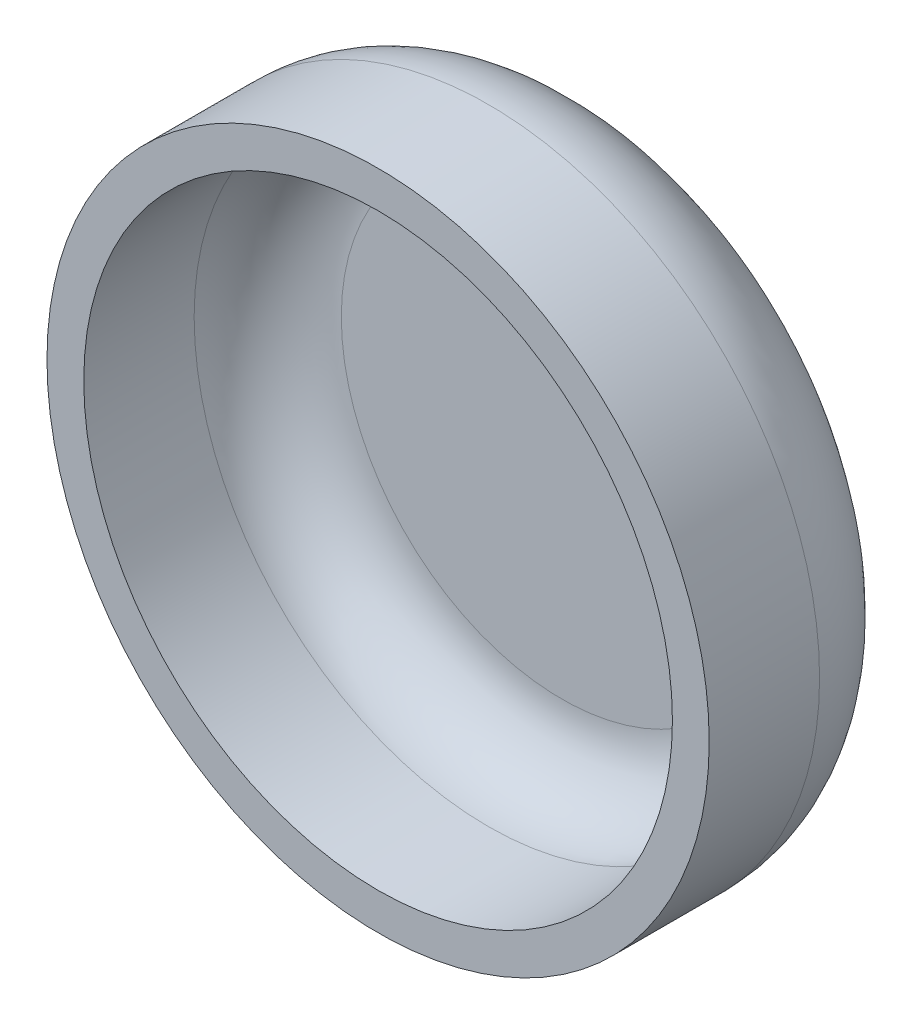
ISO-10303-21;
HEADER;
FILE_DESCRIPTION(('STEP AP214'),'2;1');
FILE_NAME('part.step','',(''),(''),'','','');
FILE_SCHEMA(('AUTOMOTIVE_DESIGN { 1 0 10303 214 1 1 1 1 }'));
ENDSEC;
DATA;
#1=APPLICATION_CONTEXT('core data for automotive mechanical design processes');
#2=APPLICATION_PROTOCOL_DEFINITION('international standard','automotive_design',2000,#1);
#3=PRODUCT_CONTEXT('',#1,'mechanical');
#4=PRODUCT('Part','Part','',(#3));
#5=PRODUCT_RELATED_PRODUCT_CATEGORY('part','',(#4));
#6=PRODUCT_DEFINITION_FORMATION('','',#4);
#7=PRODUCT_DEFINITION_CONTEXT('part definition',#1,'design');
#8=PRODUCT_DEFINITION('design','',#6,#7);
#9=PRODUCT_DEFINITION_SHAPE('','',#8);
#10=(LENGTH_UNIT() NAMED_UNIT(*) SI_UNIT(.MILLI.,.METRE.));
#11=(NAMED_UNIT(*) PLANE_ANGLE_UNIT() SI_UNIT($,.RADIAN.));
#12=(NAMED_UNIT(*) SI_UNIT($,.STERADIAN.) SOLID_ANGLE_UNIT());
#13=UNCERTAINTY_MEASURE_WITH_UNIT(LENGTH_MEASURE(1.E-05),#10,'distance_accuracy_value','');
#14=(GEOMETRIC_REPRESENTATION_CONTEXT(3) GLOBAL_UNCERTAINTY_ASSIGNED_CONTEXT((#13)) GLOBAL_UNIT_ASSIGNED_CONTEXT((#10,
#11,#12)) REPRESENTATION_CONTEXT('',''));
#15=CARTESIAN_POINT('',(0.,0.,0.));
#16=DIRECTION('',(0.,0.,1.));
#17=DIRECTION('',(1.,0.,0.));
#18=AXIS2_PLACEMENT_3D('',#15,#16,#17);
#19=CARTESIAN_POINT('',(0.,0.,2.25));
#20=DIRECTION('',(0.,0.,-1.));
#21=DIRECTION('',(-1.,0.,0.));
#22=AXIS2_PLACEMENT_3D('',#19,#20,#21);
#23=CYLINDRICAL_SURFACE('',#22,4.);
#24=CARTESIAN_POINT('',(0.,0.,1.5));
#25=DIRECTION('',(0.,0.,-1.));
#26=DIRECTION('',(1.,0.,0.));
#27=AXIS2_PLACEMENT_3D('',#24,#25,#26);
#28=CIRCLE('',#27,4.);
#29=CARTESIAN_POINT('',(-4.,0.,1.5));
#30=VERTEX_POINT('',#29);
#31=CARTESIAN_POINT('',(4.,0.,1.5));
#32=VERTEX_POINT('',#31);
#33=EDGE_CURVE('E149',#30,#32,#28,.T.);
#34=ORIENTED_EDGE('',*,*,#33,.T.);
#35=DIRECTION('',(0.,0.,1.));
#36=VECTOR('',#35,1.);
#37=CARTESIAN_POINT('',(4.,0.,2.25));
#38=LINE('',#37,#36);
#39=CARTESIAN_POINT('',(4.,0.,3.));
#40=VERTEX_POINT('',#39);
#41=EDGE_CURVE('E11',#32,#40,#38,.T.);
#42=ORIENTED_EDGE('',*,*,#41,.T.);
#43=CARTESIAN_POINT('',(0.,0.,3.));
#44=DIRECTION('',(0.,0.,-1.));
#45=DIRECTION('',(1.,0.,0.));
#46=AXIS2_PLACEMENT_3D('',#43,#44,#45);
#47=CIRCLE('',#46,4.);
#48=CARTESIAN_POINT('',(-4.,0.,3.));
#49=VERTEX_POINT('',#48);
#50=EDGE_CURVE('E102',#49,#40,#47,.T.);
#51=ORIENTED_EDGE('',*,*,#50,.F.);
#52=CARTESIAN_POINT('',(0.,0.,3.));
#53=DIRECTION('',(0.,0.,-1.));
#54=DIRECTION('',(1.,0.,0.));
#55=AXIS2_PLACEMENT_3D('',#52,#53,#54);
#56=CIRCLE('',#55,4.);
#57=EDGE_CURVE('E116',#40,#49,#56,.T.);
#58=ORIENTED_EDGE('',*,*,#57,.F.);
#59=ORIENTED_EDGE('',*,*,#41,.F.);
#60=CARTESIAN_POINT('',(0.,0.,1.5));
#61=DIRECTION('',(0.,0.,-1.));
#62=DIRECTION('',(1.,0.,0.));
#63=AXIS2_PLACEMENT_3D('',#60,#61,#62);
#64=CIRCLE('',#63,4.);
#65=EDGE_CURVE('E26',#32,#30,#64,.T.);
#66=ORIENTED_EDGE('',*,*,#65,.T.);
#67=EDGE_LOOP('',(#34,#42,#51,#58,#59,#66));
#68=FACE_BOUND('',#67,.T.);
#69=ADVANCED_FACE('F16',(#68),#23,.F.);
#70=CARTESIAN_POINT('',(0.,0.,1.5));
#71=DIRECTION('',(0.,0.,-1.));
#72=DIRECTION('',(-1.,0.,0.));
#73=AXIS2_PLACEMENT_3D('',#70,#71,#72);
#74=TOROIDAL_SURFACE('',#73,3.,1.);
#75=CARTESIAN_POINT('',(0.,0.,0.5));
#76=DIRECTION('',(0.,0.,-1.));
#77=DIRECTION('',(1.,0.,0.));
#78=AXIS2_PLACEMENT_3D('',#75,#76,#77);
#79=CIRCLE('',#78,3.);
#80=CARTESIAN_POINT('',(-3.,0.,0.5));
#81=VERTEX_POINT('',#80);
#82=CARTESIAN_POINT('',(3.,0.,0.5));
#83=VERTEX_POINT('',#82);
#84=EDGE_CURVE('E114',#81,#83,#79,.T.);
#85=ORIENTED_EDGE('',*,*,#84,.T.);
#86=CARTESIAN_POINT('',(3.,0.,1.5));
#87=DIRECTION('',(0.,-1.,0.));
#88=DIRECTION('',(1.,0.,0.));
#89=AXIS2_PLACEMENT_3D('',#86,#87,#88);
#90=CIRCLE('',#89,1.);
#91=EDGE_CURVE('E19',#83,#32,#90,.T.);
#92=ORIENTED_EDGE('',*,*,#91,.T.);
#93=ORIENTED_EDGE('',*,*,#33,.F.);
#94=ORIENTED_EDGE('',*,*,#65,.F.);
#95=ORIENTED_EDGE('',*,*,#91,.F.);
#96=CARTESIAN_POINT('',(0.,0.,0.5));
#97=DIRECTION('',(0.,0.,-1.));
#98=DIRECTION('',(1.,0.,0.));
#99=AXIS2_PLACEMENT_3D('',#96,#97,#98);
#100=CIRCLE('',#99,3.);
#101=EDGE_CURVE('E63',#83,#81,#100,.T.);
#102=ORIENTED_EDGE('',*,*,#101,.T.);
#103=EDGE_LOOP('',(#85,#92,#93,#94,#95,#102));
#104=FACE_BOUND('',#103,.T.);
#105=ADVANCED_FACE('F154',(#104),#74,.F.);
#106=CARTESIAN_POINT('',(-3.,0.,0.5));
#107=DIRECTION('',(0.,0.,1.));
#108=DIRECTION('',(1.,0.,0.));
#109=AXIS2_PLACEMENT_3D('',#106,#107,#108);
#110=PLANE('',#109);
#111=ORIENTED_EDGE('',*,*,#84,.F.);
#112=ORIENTED_EDGE('',*,*,#101,.F.);
#113=EDGE_LOOP('',(#111,#112));
#114=FACE_BOUND('',#113,.T.);
#115=ADVANCED_FACE('F156',(#114),#110,.T.);
#116=CARTESIAN_POINT('',(0.,0.,0.));
#117=DIRECTION('',(0.,0.,-1.));
#118=DIRECTION('',(0.,-1.,0.));
#119=AXIS2_PLACEMENT_3D('',#116,#117,#118);
#120=PLANE('',#119);
#121=CARTESIAN_POINT('',(0.,0.,0.));
#122=DIRECTION('',(0.,0.,-1.));
#123=DIRECTION('',(1.,0.,0.));
#124=AXIS2_PLACEMENT_3D('',#121,#122,#123);
#125=CIRCLE('',#124,3.);
#126=CARTESIAN_POINT('',(-3.,0.,0.));
#127=VERTEX_POINT('',#126);
#128=CARTESIAN_POINT('',(3.,0.,0.));
#129=VERTEX_POINT('',#128);
#130=EDGE_CURVE('E137',#127,#129,#125,.T.);
#131=ORIENTED_EDGE('',*,*,#130,.T.);
#132=CARTESIAN_POINT('',(0.,0.,0.));
#133=DIRECTION('',(0.,0.,-1.));
#134=DIRECTION('',(1.,0.,0.));
#135=AXIS2_PLACEMENT_3D('',#132,#133,#134);
#136=CIRCLE('',#135,3.);
#137=EDGE_CURVE('E115',#129,#127,#136,.T.);
#138=ORIENTED_EDGE('',*,*,#137,.T.);
#139=EDGE_LOOP('',(#131,#138));
#140=FACE_BOUND('',#139,.T.);
#141=ADVANCED_FACE('F158',(#140),#120,.T.);
#142=CARTESIAN_POINT('',(0.,0.,1.5));
#143=DIRECTION('',(0.,0.,-1.));
#144=DIRECTION('',(-1.,0.,0.));
#145=AXIS2_PLACEMENT_3D('',#142,#143,#144);
#146=TOROIDAL_SURFACE('',#145,3.,1.5);
#147=ORIENTED_EDGE('',*,*,#130,.F.);
#148=ORIENTED_EDGE('',*,*,#137,.F.);
#149=CARTESIAN_POINT('',(3.,0.,1.5));
#150=DIRECTION('',(0.,-1.,0.));
#151=DIRECTION('',(1.,0.,0.));
#152=AXIS2_PLACEMENT_3D('',#149,#150,#151);
#153=CIRCLE('',#152,1.5);
#154=CARTESIAN_POINT('',(4.5,0.,1.5));
#155=VERTEX_POINT('',#154);
#156=EDGE_CURVE('E75',#129,#155,#153,.T.);
#157=ORIENTED_EDGE('',*,*,#156,.T.);
#158=CARTESIAN_POINT('',(0.,0.,1.5));
#159=DIRECTION('',(0.,0.,-1.));
#160=DIRECTION('',(1.,0.,0.));
#161=AXIS2_PLACEMENT_3D('',#158,#159,#160);
#162=CIRCLE('',#161,4.5);
#163=CARTESIAN_POINT('',(-4.5,0.,1.5));
#164=VERTEX_POINT('',#163);
#165=EDGE_CURVE('E127',#155,#164,#162,.T.);
#166=ORIENTED_EDGE('',*,*,#165,.T.);
#167=CARTESIAN_POINT('',(0.,0.,1.5));
#168=DIRECTION('',(0.,0.,-1.));
#169=DIRECTION('',(1.,0.,0.));
#170=AXIS2_PLACEMENT_3D('',#167,#168,#169);
#171=CIRCLE('',#170,4.5);
#172=EDGE_CURVE('E118',#164,#155,#171,.T.);
#173=ORIENTED_EDGE('',*,*,#172,.T.);
#174=ORIENTED_EDGE('',*,*,#156,.F.);
#175=EDGE_LOOP('',(#147,#148,#157,#166,#173,#174));
#176=FACE_BOUND('',#175,.T.);
#177=ADVANCED_FACE('F165',(#176),#146,.T.);
#178=CARTESIAN_POINT('',(0.,0.,2.25));
#179=DIRECTION('',(0.,0.,-1.));
#180=DIRECTION('',(-1.,0.,0.));
#181=AXIS2_PLACEMENT_3D('',#178,#179,#180);
#182=CYLINDRICAL_SURFACE('',#181,4.5);
#183=ORIENTED_EDGE('',*,*,#172,.F.);
#184=ORIENTED_EDGE('',*,*,#165,.F.);
#185=DIRECTION('',(0.,0.,1.));
#186=VECTOR('',#185,1.);
#187=CARTESIAN_POINT('',(4.5,0.,2.25));
#188=LINE('',#187,#186);
#189=CARTESIAN_POINT('',(4.5,0.,3.));
#190=VERTEX_POINT('',#189);
#191=EDGE_CURVE('E90',#155,#190,#188,.T.);
#192=ORIENTED_EDGE('',*,*,#191,.T.);
#193=CARTESIAN_POINT('',(0.,0.,3.));
#194=DIRECTION('',(0.,0.,-1.));
#195=DIRECTION('',(1.,0.,0.));
#196=AXIS2_PLACEMENT_3D('',#193,#194,#195);
#197=CIRCLE('',#196,4.5);
#198=CARTESIAN_POINT('',(-4.5,0.,3.));
#199=VERTEX_POINT('',#198);
#200=EDGE_CURVE('E95',#190,#199,#197,.T.);
#201=ORIENTED_EDGE('',*,*,#200,.T.);
#202=CARTESIAN_POINT('',(0.,0.,3.));
#203=DIRECTION('',(0.,0.,-1.));
#204=DIRECTION('',(1.,0.,0.));
#205=AXIS2_PLACEMENT_3D('',#202,#203,#204);
#206=CIRCLE('',#205,4.5);
#207=EDGE_CURVE('E99',#199,#190,#206,.T.);
#208=ORIENTED_EDGE('',*,*,#207,.T.);
#209=ORIENTED_EDGE('',*,*,#191,.F.);
#210=EDGE_LOOP('',(#183,#184,#192,#201,#208,#209));
#211=FACE_BOUND('',#210,.T.);
#212=ADVANCED_FACE('F98',(#211),#182,.T.);
#213=CARTESIAN_POINT('',(-4.5,0.,3.));
#214=DIRECTION('',(0.,0.,1.));
#215=DIRECTION('',(1.,0.,0.));
#216=AXIS2_PLACEMENT_3D('',#213,#214,#215);
#217=PLANE('',#216);
#218=ORIENTED_EDGE('',*,*,#50,.T.);
#219=ORIENTED_EDGE('',*,*,#57,.T.);
#220=EDGE_LOOP('',(#218,#219));
#221=FACE_BOUND('',#220,.T.);
#222=ORIENTED_EDGE('',*,*,#207,.F.);
#223=ORIENTED_EDGE('',*,*,#200,.F.);
#224=EDGE_LOOP('',(#222,#223));
#225=FACE_BOUND('',#224,.T.);
#226=ADVANCED_FACE('F103',(#221,#225),#217,.T.);
#227=CLOSED_SHELL('',(#69,#105,#115,#141,#177,#212,#226));
#228=MANIFOLD_SOLID_BREP('B1',#227);
#229=ADVANCED_BREP_SHAPE_REPRESENTATION('',(#18,#228),#14);
#230=SHAPE_DEFINITION_REPRESENTATION(#9,#229);
ENDSEC;
END-ISO-10303-21;
